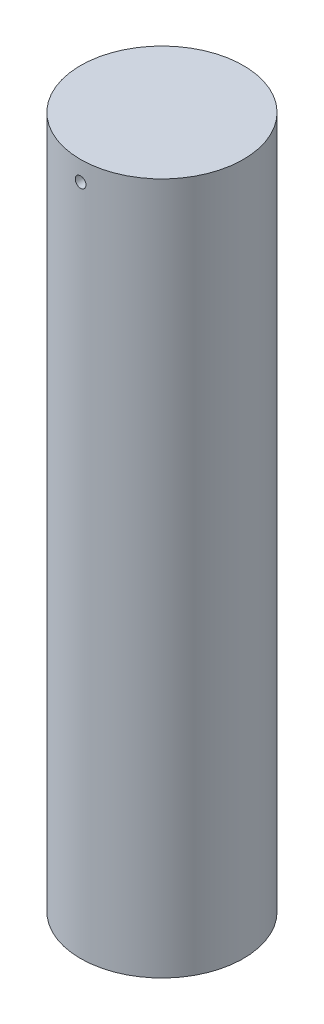
ISO-10303-21;
HEADER;
FILE_DESCRIPTION(('STEP AP214'),'2;1');
FILE_NAME('part.step','',(''),(''),'','','');
FILE_SCHEMA(('AUTOMOTIVE_DESIGN { 1 0 10303 214 1 1 1 1 }'));
ENDSEC;
DATA;
#1=APPLICATION_CONTEXT('core data for automotive mechanical design processes');
#2=APPLICATION_PROTOCOL_DEFINITION('international standard','automotive_design',2000,#1);
#3=PRODUCT_CONTEXT('',#1,'mechanical');
#4=PRODUCT('Part','Part','',(#3));
#5=PRODUCT_RELATED_PRODUCT_CATEGORY('part','',(#4));
#6=PRODUCT_DEFINITION_FORMATION('','',#4);
#7=PRODUCT_DEFINITION_CONTEXT('part definition',#1,'design');
#8=PRODUCT_DEFINITION('design','',#6,#7);
#9=PRODUCT_DEFINITION_SHAPE('','',#8);
#10=(LENGTH_UNIT() NAMED_UNIT(*) SI_UNIT(.MILLI.,.METRE.));
#11=(NAMED_UNIT(*) PLANE_ANGLE_UNIT() SI_UNIT($,.RADIAN.));
#12=(NAMED_UNIT(*) SI_UNIT($,.STERADIAN.) SOLID_ANGLE_UNIT());
#13=UNCERTAINTY_MEASURE_WITH_UNIT(LENGTH_MEASURE(1.E-05),#10,'distance_accuracy_value','');
#14=(GEOMETRIC_REPRESENTATION_CONTEXT(3) GLOBAL_UNCERTAINTY_ASSIGNED_CONTEXT((#13)) GLOBAL_UNIT_ASSIGNED_CONTEXT((#10,
#11,#12)) REPRESENTATION_CONTEXT('',''));
#15=CARTESIAN_POINT('',(0.,0.,0.));
#16=DIRECTION('',(0.,0.,1.));
#17=DIRECTION('',(1.,0.,0.));
#18=AXIS2_PLACEMENT_3D('',#15,#16,#17);
#19=CARTESIAN_POINT('',(0.,53.975,0.));
#20=DIRECTION('',(0.,-1.,0.));
#21=DIRECTION('',(0.,0.,-1.));
#22=AXIS2_PLACEMENT_3D('',#19,#20,#21);
#23=CYLINDRICAL_SURFACE('',#22,6.35);
#24=CARTESIAN_POINT('',(0.,52.8671504859534,-6.35));
#25=CARTESIAN_POINT('',(-0.0235121808870548,52.8667581320829,-6.3499998176919));
#26=CARTESIAN_POINT('',(-0.0470077551217763,52.86438204226,-6.34986801925479));
#27=CARTESIAN_POINT('',(-0.0932837931493646,52.8557218479371,-6.34935708644453));
#28=CARTESIAN_POINT('',(-0.116063394516243,52.8494332068359,-6.3489776649275));
#29=CARTESIAN_POINT('',(-0.160231393892967,52.8331298744789,-6.3480165144024));
#30=CARTESIAN_POINT('',(-0.181620529863726,52.8231171789713,-6.34743489376521));
#31=CARTESIAN_POINT('',(-0.22240924218623,52.7996530423272,-6.34613670539577));
#32=CARTESIAN_POINT('',(-0.241809269161029,52.7862023824676,-6.34542016833298));
#33=CARTESIAN_POINT('',(-0.278106879039815,52.756219438659,-6.34393313281511));
#34=CARTESIAN_POINT('',(-0.295000728170861,52.7396826380306,-6.34316255631655));
#35=CARTESIAN_POINT('',(-0.325774985416091,52.704006847667,-6.34165661914458));
#36=CARTESIAN_POINT('',(-0.339655268907535,52.6848677503699,-6.34092125992851));
#37=CARTESIAN_POINT('',(-0.364017696312383,52.6445121506533,-6.3395694387411));
#38=CARTESIAN_POINT('',(-0.374497161324545,52.6232940275837,-6.33895307065584));
#39=CARTESIAN_POINT('',(-0.391743267143485,52.5793946734526,-6.33791072156201));
#40=CARTESIAN_POINT('',(-0.398509953742357,52.5567134604401,-6.33748473820533));
#41=CARTESIAN_POINT('',(-0.408128440990059,52.5105691897924,-6.33687262220416));
#42=CARTESIAN_POINT('',(-0.410986302526075,52.4871074004931,-6.33668611825884));
#43=CARTESIAN_POINT('',(-0.412724340674793,52.4400364955187,-6.33657316170687));
#44=CARTESIAN_POINT('',(-0.411604564433647,52.4164273815931,-6.33664670601793));
#45=CARTESIAN_POINT('',(-0.405424395663394,52.3697688532499,-6.33704508757379));
#46=CARTESIAN_POINT('',(-0.400369863701263,52.3467186589621,-6.33736955108578));
#47=CARTESIAN_POINT('',(-0.386472307322249,52.3017944184635,-6.33823218605785));
#48=CARTESIAN_POINT('',(-0.37762925510077,52.2799203808859,-6.33877035908638));
#49=CARTESIAN_POINT('',(-0.356397042318563,52.2379469273926,-6.33999951002195));
#50=CARTESIAN_POINT('',(-0.344004684776578,52.2178491328531,-6.3406906255614));
#51=CARTESIAN_POINT('',(-0.316028294181541,52.1800164424554,-6.34214645717292));
#52=CARTESIAN_POINT('',(-0.300444221623162,52.1622815758488,-6.34291117415592));
#53=CARTESIAN_POINT('',(-0.266491815120564,52.1296433363971,-6.34442832349846));
#54=CARTESIAN_POINT('',(-0.248118292292305,52.1147453596004,-6.34518073000694));
#55=CARTESIAN_POINT('',(-0.20912780173685,52.0882446616418,-6.34658534133829));
#56=CARTESIAN_POINT('',(-0.188510835146335,52.0766419388104,-6.34723754621193));
#57=CARTESIAN_POINT('',(-0.145618463976587,52.0570630652059,-6.34836632329911));
#58=CARTESIAN_POINT('',(-0.12334317850945,52.0490866542576,-6.34884290811232));
#59=CARTESIAN_POINT('',(-0.0777658446149477,52.0369882263907,-6.34956467555287));
#60=CARTESIAN_POINT('',(-0.0544638097408665,52.03286615861,-6.34980986123377));
#61=CARTESIAN_POINT('',(-0.00754206873443993,52.0285992946195,-6.3500387706766));
#62=CARTESIAN_POINT('',(0.0160769463898694,52.0284469241869,-6.35002299245439));
#63=CARTESIAN_POINT('',(0.0630043844376729,52.0321045573814,-6.34973079032105));
#64=CARTESIAN_POINT('',(0.0863128089165778,52.0359145411579,-6.34945436771569));
#65=CARTESIAN_POINT('',(0.131939462624359,52.0473828130872,-6.34867013733476));
#66=CARTESIAN_POINT('',(0.154258438876021,52.0550381422807,-6.34816250749906));
#67=CARTESIAN_POINT('',(0.197294841250552,52.0739769850823,-6.34697082348154));
#68=CARTESIAN_POINT('',(0.218012250467903,52.0852605369821,-6.34628676743776));
#69=CARTESIAN_POINT('',(0.257292952433639,52.1111561998571,-6.34481582323307));
#70=CARTESIAN_POINT('',(0.275852822634491,52.125773493302,-6.34402877578746));
#71=CARTESIAN_POINT('',(0.310257878866365,52.1579135229472,-6.34243937913899));
#72=CARTESIAN_POINT('',(0.326103036677881,52.1754362893462,-6.34163702977717));
#73=CARTESIAN_POINT('',(0.354652324185127,52.2129208993857,-6.34010465427353));
#74=CARTESIAN_POINT('',(0.36735180938826,52.2328862853178,-6.33937473601528));
#75=CARTESIAN_POINT('',(0.389218021978921,52.2746706830239,-6.33806988389596));
#76=CARTESIAN_POINT('',(0.39838477603609,52.2964896808029,-6.33749494886488));
#77=CARTESIAN_POINT('',(0.412916359471077,52.341341354149,-6.33656479798943));
#78=CARTESIAN_POINT('',(0.418284681597988,52.3643728937583,-6.33620938033192));
#79=CARTESIAN_POINT('',(0.425078521544848,52.4110127605098,-6.33575725900702));
#80=CARTESIAN_POINT('',(0.426504082945455,52.4346210812739,-6.33566055248002));
#81=CARTESIAN_POINT('',(0.425372436856504,52.4816970303904,-6.33573662364808));
#82=CARTESIAN_POINT('',(0.422822709464873,52.505164839771,-6.33590889522168));
#83=CARTESIAN_POINT('',(0.413827766097413,52.5513383077771,-6.33650271356473));
#84=CARTESIAN_POINT('',(0.407382539773461,52.5740439643778,-6.33692426099635));
#85=CARTESIAN_POINT('',(0.39078014593362,52.6180528187149,-6.33796967651021));
#86=CARTESIAN_POINT('',(0.380622543414843,52.6393558517515,-6.33859356830146));
#87=CARTESIAN_POINT('',(0.356884653464621,52.6799552663342,-6.33997429780491));
#88=CARTESIAN_POINT('',(0.343304448888382,52.6992516964406,-6.34073113229866));
#89=CARTESIAN_POINT('',(0.313077364564546,52.7353287950483,-6.34229543526246));
#90=CARTESIAN_POINT('',(0.296424948779817,52.7521048212277,-6.34310299337421));
#91=CARTESIAN_POINT('',(0.260534907825676,52.7826289932831,-6.34467836184365));
#92=CARTESIAN_POINT('',(0.241296654236522,52.7963764009832,-6.3454461624763));
#93=CARTESIAN_POINT('',(0.200759502419833,52.820462624429,-6.34685805521148));
#94=CARTESIAN_POINT('',(0.179458140137624,52.8307972976308,-6.34750199657477));
#95=CARTESIAN_POINT('',(0.135433640325118,52.8477303594414,-6.34859359109605));
#96=CARTESIAN_POINT('',(0.112712199262232,52.8543331150191,-6.34904147353679));
#97=CARTESIAN_POINT('',(0.0748779443028039,52.8619445932453,-6.34957571328361));
#98=CARTESIAN_POINT('',(0.0599894591523732,52.8641132093727,-6.34973425519039));
#99=CARTESIAN_POINT('',(0.030065054095504,52.866841551917,-6.34994645672714));
#100=CARTESIAN_POINT('',(0.0150291344356422,52.8674012810241,-6.35000011653249));
#101=CARTESIAN_POINT('',(0.,52.8671504859534,-6.35));
#102=B_SPLINE_CURVE_WITH_KNOTS('',3,(#24,#25,#26,#27,#28,#29,#30,#31,#32,#33,#34,#35,#36,#37,
#38,#39,#40,#41,#42,#43,#44,#45,#46,#47,#48,#49,#50,#51,#52,#53,#54,#55,#56,#57,#58,#59,#60,#61,
#62,#63,#64,#65,#66,#67,#68,#69,#70,#71,#72,#73,#74,#75,#76,#77,#78,#79,#80,#81,#82,#83,#84,#85,
#86,#87,#88,#89,#90,#91,#92,#93,#94,#95,#96,#97,#98,#99,#100,#101),.UNSPECIFIED.,.T.,.F.,(4,2,2,
2,2,2,2,2,2,2,2,2,2,2,2,2,2,2,2,2,2,2,2,2,2,2,2,2,2,2,2,2,2,2,2,2,2,2,4),(0.,0.0704914823468394,
0.141064852250075,0.211600455734289,0.282120044245526,0.35274366184366,0.423370199448886,
0.494052236881286,0.564733402526845,0.635304847711983,0.705875456430585,0.776341155381145,
0.846807371500346,0.917337259655849,0.987868020845013,1.05853162706817,1.12919519748854,
1.19985369724337,1.27051126457201,1.34103400665196,1.41155639542737,1.48202460078849,
1.55249354988303,1.62307280237135,1.69365278848834,1.76433637089343,1.83501941967666,
1.90563738894114,1.97625457763836,2.04673904985832,2.11722370931623,2.18771663056236,
2.25820784546212,2.32882734669572,2.39946404127369,2.47018616561832,2.5408253609799,
2.58588403679497,2.63094263726455),.UNSPECIFIED.);
#103=CARTESIAN_POINT('',(0.,52.8671504859534,-6.35));
#104=VERTEX_POINT('',#103);
#105=EDGE_CURVE('E40',#104,#104,#102,.T.);
#106=ORIENTED_EDGE('',*,*,#105,.T.);
#107=EDGE_LOOP('',(#106));
#108=FACE_BOUND('',#107,.T.);
#109=CARTESIAN_POINT('',(0.412140714463366,52.4481085190968,6.33661108412704));
#110=CARTESIAN_POINT('',(0.412139680658585,52.4245950105095,6.33661126795857));
#111=CARTESIAN_POINT('',(0.410155089522609,52.4010651052304,6.33674119932918));
#112=CARTESIAN_POINT('',(0.402266772248485,52.3546552094742,6.33724675720743));
#113=CARTESIAN_POINT('',(0.39635850231033,52.3317760046093,6.33762266856376));
#114=CARTESIAN_POINT('',(0.380793482102243,52.2873464685624,6.33857687205118));
#115=CARTESIAN_POINT('',(0.371138732154918,52.2657954353459,6.33915505616849));
#116=CARTESIAN_POINT('',(0.348358155425402,52.2246253078344,6.34044762802944));
#117=CARTESIAN_POINT('',(0.33523311562576,52.2050057769014,6.34116198488196));
#118=CARTESIAN_POINT('',(0.305860777441405,52.1682174407613,6.34264653696399));
#119=CARTESIAN_POINT('',(0.289608929194041,52.1510522711661,6.34341681253192));
#120=CARTESIAN_POINT('',(0.254453816547636,52.1196910500662,6.34492412429492));
#121=CARTESIAN_POINT('',(0.235550440847929,52.1054951232608,6.34566115909296));
#122=CARTESIAN_POINT('',(0.195608247065886,52.0804640461601,6.3470179192208));
#123=CARTESIAN_POINT('',(0.17456752781638,52.0696319233297,6.34763753868101));
#124=CARTESIAN_POINT('',(0.130961299622952,52.0516553192142,6.34868681664816));
#125=CARTESIAN_POINT('',(0.108395808535012,52.0445107947537,6.34911647737917));
#126=CARTESIAN_POINT('',(0.0624158229062691,52.0341223350426,6.34973478517745));
#127=CARTESIAN_POINT('',(0.0390026258041816,52.0308726786442,6.34992378577448));
#128=CARTESIAN_POINT('',(-0.00803755051120692,52.0283485303536,6.35003846472521));
#129=CARTESIAN_POINT('',(-0.0316645270789861,52.0290739893365,6.34996414633306));
#130=CARTESIAN_POINT('',(-0.0784228263354628,52.0344747655436,6.34955870987684));
#131=CARTESIAN_POINT('',(-0.101554863717206,52.0391439288548,6.34922799197475));
#132=CARTESIAN_POINT('',(-0.146705887991355,52.0522900207097,6.34834526433024));
#133=CARTESIAN_POINT('',(-0.16872486769885,52.0607669738296,6.34779325315955));
#134=CARTESIAN_POINT('',(-0.211044515767995,52.0812949678648,6.34652733584681));
#135=CARTESIAN_POINT('',(-0.231343829789023,52.0933487927549,6.34581330370174));
#136=CARTESIAN_POINT('',(-0.269633199814402,52.1206863418158,6.34430182643358));
#137=CARTESIAN_POINT('',(-0.287623226735549,52.135970106658,6.34350438026019));
#138=CARTESIAN_POINT('',(-0.320819349088148,52.1693684310111,6.34191235059442));
#139=CARTESIAN_POINT('',(-0.336020070639424,52.1874883327792,6.34111777546017));
#140=CARTESIAN_POINT('',(-0.363164717456667,52.226025871568,6.33962118694406));
#141=CARTESIAN_POINT('',(-0.375108641260708,52.2464435096201,6.33891917360376));
#142=CARTESIAN_POINT('',(-0.395400355988582,52.2890004078439,6.33768588789545));
#143=CARTESIAN_POINT('',(-0.403747912805006,52.311139779982,6.3371546266432));
#144=CARTESIAN_POINT('',(-0.416606235962917,52.3565100901791,6.33632236554127));
#145=CARTESIAN_POINT('',(-0.421117052667971,52.3797410139056,6.33602136266906));
#146=CARTESIAN_POINT('',(-0.426167167004521,52.4265880890578,6.33568371007482));
#147=CARTESIAN_POINT('',(-0.426713937623124,52.4502034314616,6.33564656293681));
#148=CARTESIAN_POINT('',(-0.42383997496531,52.4971902124252,6.33583946052165));
#149=CARTESIAN_POINT('',(-0.420419264746111,52.5205616524017,6.33606950369171));
#150=CARTESIAN_POINT('',(-0.409713631832374,52.5663760175357,6.33677072155371));
#151=CARTESIAN_POINT('',(-0.40243215763114,52.5888197520791,6.33724168104232));
#152=CARTESIAN_POINT('',(-0.384215143099342,52.6321666065665,6.33837215123243));
#153=CARTESIAN_POINT('',(-0.37327956582076,52.65306971093,6.33903166384046));
#154=CARTESIAN_POINT('',(-0.348045637117435,52.6927762526273,6.34046714132347));
#155=CARTESIAN_POINT('',(-0.333742282276913,52.711576503909,6.3412432788381));
#156=CARTESIAN_POINT('',(-0.302186021215499,52.7465115584496,6.34282527952411));
#157=CARTESIAN_POINT('',(-0.284933082892457,52.7626463326947,6.34363114301895));
#158=CARTESIAN_POINT('',(-0.247935146773134,52.7918177094957,6.34518485567072));
#159=CARTESIAN_POINT('',(-0.228186329157566,52.8048494729584,6.34593261300465));
#160=CARTESIAN_POINT('',(-0.186776344369629,52.8274117777349,6.34728628449235));
#161=CARTESIAN_POINT('',(-0.16511519009265,52.8369423426559,6.3478921996025));
#162=CARTESIAN_POINT('',(-0.120513081655034,52.8522233110465,6.34889544497011));
#163=CARTESIAN_POINT('',(-0.0975731771294197,52.8579767667158,6.34929294359196));
#164=CARTESIAN_POINT('',(-0.0510501530271388,52.8655501839004,6.34983738512592));
#165=CARTESIAN_POINT('',(-0.0274670406459308,52.8673701894002,6.34998433083974));
#166=CARTESIAN_POINT('',(0.0196251060546166,52.8670246056364,6.35001324813419));
#167=CARTESIAN_POINT('',(0.0431341959785421,52.8648665846573,6.34989572278305));
#168=CARTESIAN_POINT('',(0.0894557005164515,52.8566419116858,6.34941212919738));
#169=CARTESIAN_POINT('',(0.112268113939148,52.8505752530102,6.34904606053789));
#170=CARTESIAN_POINT('',(0.156549701843585,52.8347072589081,6.34810862001581));
#171=CARTESIAN_POINT('',(0.178018893727953,52.8249059718787,6.34753725081373));
#172=CARTESIAN_POINT('',(0.219008168896406,52.8018479546312,6.34625530743297));
#173=CARTESIAN_POINT('',(0.238528299774461,52.7885913088178,6.34554473665471));
#174=CARTESIAN_POINT('',(0.275103750806293,52.7589707959284,6.34406448191281));
#175=CARTESIAN_POINT('',(0.292154611751924,52.7426014279302,6.34329469475587));
#176=CARTESIAN_POINT('',(0.323272438929633,52.7072280896443,6.34178510576932));
#177=CARTESIAN_POINT('',(0.337338675075324,52.6882234766097,6.34104531131211));
#178=CARTESIAN_POINT('',(0.362099558841448,52.6480951932732,6.33967967421537));
#179=CARTESIAN_POINT('',(0.372789687992434,52.6269687325543,6.33905398475918));
#180=CARTESIAN_POINT('',(0.39045770735842,52.5832319367336,6.33799036383867));
#181=CARTESIAN_POINT('',(0.397439933671175,52.5606233697671,6.33755221317955));
#182=CARTESIAN_POINT('',(0.405684528521067,52.5229157460718,6.33702846002333));
#183=CARTESIAN_POINT('',(0.408102454087361,52.5080602631113,6.33687265490352));
#184=CARTESIAN_POINT('',(0.411330876347419,52.4781749280499,6.33666390825735));
#185=CARTESIAN_POINT('',(0.412141375566943,52.463145076223,6.33661096656936));
#186=CARTESIAN_POINT('',(0.412140714463366,52.4481085190968,6.33661108412704));
#187=B_SPLINE_CURVE_WITH_KNOTS('',3,(#109,#110,#111,#112,#113,#114,#115,#116,#117,#118,#119,
#120,#121,#122,#123,#124,#125,#126,#127,#128,#129,#130,#131,#132,#133,#134,#135,#136,#137,#138,
#139,#140,#141,#142,#143,#144,#145,#146,#147,#148,#149,#150,#151,#152,#153,#154,#155,#156,#157,
#158,#159,#160,#161,#162,#163,#164,#165,#166,#167,#168,#169,#170,#171,#172,#173,#174,#175,#176,
#177,#178,#179,#180,#181,#182,#183,#184,#185,#186),.UNSPECIFIED.,.T.,.F.,(4,2,2,2,2,2,2,2,2,2,2,
2,2,2,2,2,2,2,2,2,2,2,2,2,2,2,2,2,2,2,2,2,2,2,2,2,2,2,4),(0.,0.0704856317419048,
0.141053031747988,0.211582806096678,0.282096599600097,0.352713785516828,0.423333936552093,
0.494017463608663,0.564700163062597,0.635278909384168,0.705856783484775,0.776324728098944,
0.846793127533498,0.917316518913101,0.987840798378505,1.05849955526869,1.12915834387648,
1.19982173136073,1.2704841912567,1.34101340414136,1.41154220714394,1.48200811860817,
1.55247474260141,1.62304672498352,1.69361947549331,1.76430157259303,1.83498319310113,
1.90560762679711,1.97623127075317,2.04672069029426,2.11721023036251,2.18769885698695,
2.25818576193389,2.32879841162434,2.39942831442217,2.47015234922447,2.54079349473843,
2.58586813299176,2.63094270041895),.UNSPECIFIED.);
#188=CARTESIAN_POINT('',(0.412140714463366,52.4481085190968,6.33661108412704));
#189=VERTEX_POINT('',#188);
#190=EDGE_CURVE('E11',#189,#189,#187,.T.);
#191=ORIENTED_EDGE('',*,*,#190,.T.);
#192=EDGE_LOOP('',(#191));
#193=FACE_BOUND('',#192,.T.);
#194=CARTESIAN_POINT('',(0.,53.975,0.));
#195=DIRECTION('',(0.,1.,0.));
#196=DIRECTION('',(0.,0.,1.));
#197=AXIS2_PLACEMENT_3D('',#194,#195,#196);
#198=CIRCLE('',#197,6.35);
#199=CARTESIAN_POINT('',(0.,53.975,6.35));
#200=VERTEX_POINT('',#199);
#201=EDGE_CURVE('E48',#200,#200,#198,.T.);
#202=ORIENTED_EDGE('',*,*,#201,.F.);
#203=EDGE_LOOP('',(#202));
#204=FACE_BOUND('',#203,.T.);
#205=CARTESIAN_POINT('',(0.,0.,0.));
#206=DIRECTION('',(0.,1.,0.));
#207=DIRECTION('',(0.,0.,1.));
#208=AXIS2_PLACEMENT_3D('',#205,#206,#207);
#209=CIRCLE('',#208,6.35);
#210=CARTESIAN_POINT('',(0.,0.,6.35));
#211=VERTEX_POINT('',#210);
#212=EDGE_CURVE('E61',#211,#211,#209,.T.);
#213=ORIENTED_EDGE('',*,*,#212,.T.);
#214=EDGE_LOOP('',(#213));
#215=FACE_BOUND('',#214,.T.);
#216=ADVANCED_FACE('F36',(#108,#193,#204,#215),#23,.T.);
#217=CARTESIAN_POINT('',(0.,53.975,0.));
#218=DIRECTION('',(0.,1.,0.));
#219=DIRECTION('',(0.,0.,1.));
#220=AXIS2_PLACEMENT_3D('',#217,#218,#219);
#221=PLANE('',#220);
#222=ORIENTED_EDGE('',*,*,#201,.T.);
#223=EDGE_LOOP('',(#222));
#224=FACE_BOUND('',#223,.T.);
#225=ADVANCED_FACE('F81',(#224),#221,.T.);
#226=CARTESIAN_POINT('',(0.,0.,0.));
#227=DIRECTION('',(0.,1.,0.));
#228=DIRECTION('',(0.,0.,1.));
#229=AXIS2_PLACEMENT_3D('',#226,#227,#228);
#230=PLANE('',#229);
#231=CARTESIAN_POINT('',(0.,0.,0.));
#232=DIRECTION('',(0.,-1.,0.));
#233=DIRECTION('',(0.,0.,-1.));
#234=AXIS2_PLACEMENT_3D('',#231,#232,#233);
#235=CIRCLE('',#234,2.55269999999999);
#236=CARTESIAN_POINT('',(0.,0.,-2.55269999999999));
#237=VERTEX_POINT('',#236);
#238=EDGE_CURVE('E62',#237,#237,#235,.T.);
#239=ORIENTED_EDGE('',*,*,#238,.F.);
#240=EDGE_LOOP('',(#239));
#241=FACE_BOUND('',#240,.T.);
#242=ORIENTED_EDGE('',*,*,#212,.F.);
#243=EDGE_LOOP('',(#242));
#244=FACE_BOUND('',#243,.T.);
#245=ADVANCED_FACE('F55',(#241,#244),#230,.F.);
#246=CARTESIAN_POINT('',(0.,25.4,0.));
#247=DIRECTION('',(0.,-1.,0.));
#248=DIRECTION('',(0.,0.,-1.));
#249=AXIS2_PLACEMENT_3D('',#246,#247,#248);
#250=CONICAL_SURFACE('',#249,2.55269999999999,1.02974425867665);
#251=CARTESIAN_POINT('',(0.,26.9338169021917,0.));
#252=VERTEX_POINT('',#251);
#253=VERTEX_LOOP('',#252);
#254=FACE_BOUND('',#253,.T.);
#255=CARTESIAN_POINT('',(0.,25.4,0.));
#256=DIRECTION('',(0.,-1.,0.));
#257=DIRECTION('',(0.,0.,-1.));
#258=AXIS2_PLACEMENT_3D('',#255,#256,#257);
#259=CIRCLE('',#258,2.55269999999999);
#260=CARTESIAN_POINT('',(0.,25.4,-2.55269999999999));
#261=VERTEX_POINT('',#260);
#262=EDGE_CURVE('E59',#261,#261,#259,.T.);
#263=ORIENTED_EDGE('',*,*,#262,.T.);
#264=EDGE_LOOP('',(#263));
#265=FACE_BOUND('',#264,.T.);
#266=ADVANCED_FACE('F51',(#254,#265),#250,.F.);
#267=CARTESIAN_POINT('',(0.,0.,0.));
#268=DIRECTION('',(0.,-1.,0.));
#269=DIRECTION('',(0.,0.,-1.));
#270=AXIS2_PLACEMENT_3D('',#267,#268,#269);
#271=CYLINDRICAL_SURFACE('',#270,2.55269999999999);
#272=ORIENTED_EDGE('',*,*,#262,.F.);
#273=EDGE_LOOP('',(#272));
#274=FACE_BOUND('',#273,.T.);
#275=ORIENTED_EDGE('',*,*,#238,.T.);
#276=EDGE_LOOP('',(#275));
#277=FACE_BOUND('',#276,.T.);
#278=ADVANCED_FACE('F54',(#274,#277),#271,.F.);
#279=CARTESIAN_POINT('',(-0.006974239232652,52.4481085190968,6.34999617007657));
#280=DIRECTION('',(-0.00109830539096846,0.,0.999999396862452));
#281=DIRECTION('',(0.999999396862452,0.,0.00109830539096846));
#282=AXIS2_PLACEMENT_3D('',#279,#280,#281);
#283=CYLINDRICAL_SURFACE('',#282,0.419099999999995);
#284=ORIENTED_EDGE('',*,*,#190,.F.);
#285=EDGE_LOOP('',(#284));
#286=FACE_BOUND('',#285,.T.);
#287=ORIENTED_EDGE('',*,*,#105,.F.);
#288=EDGE_LOOP('',(#287));
#289=FACE_BOUND('',#288,.T.);
#290=ADVANCED_FACE('F73',(#286,#289),#283,.F.);
#291=CLOSED_SHELL('',(#216,#225,#245,#266,#278,#290));
#292=MANIFOLD_SOLID_BREP('B2',#291);
#293=ADVANCED_BREP_SHAPE_REPRESENTATION('',(#18,#292),#14);
#294=SHAPE_DEFINITION_REPRESENTATION(#9,#293);
ENDSEC;
END-ISO-10303-21;
